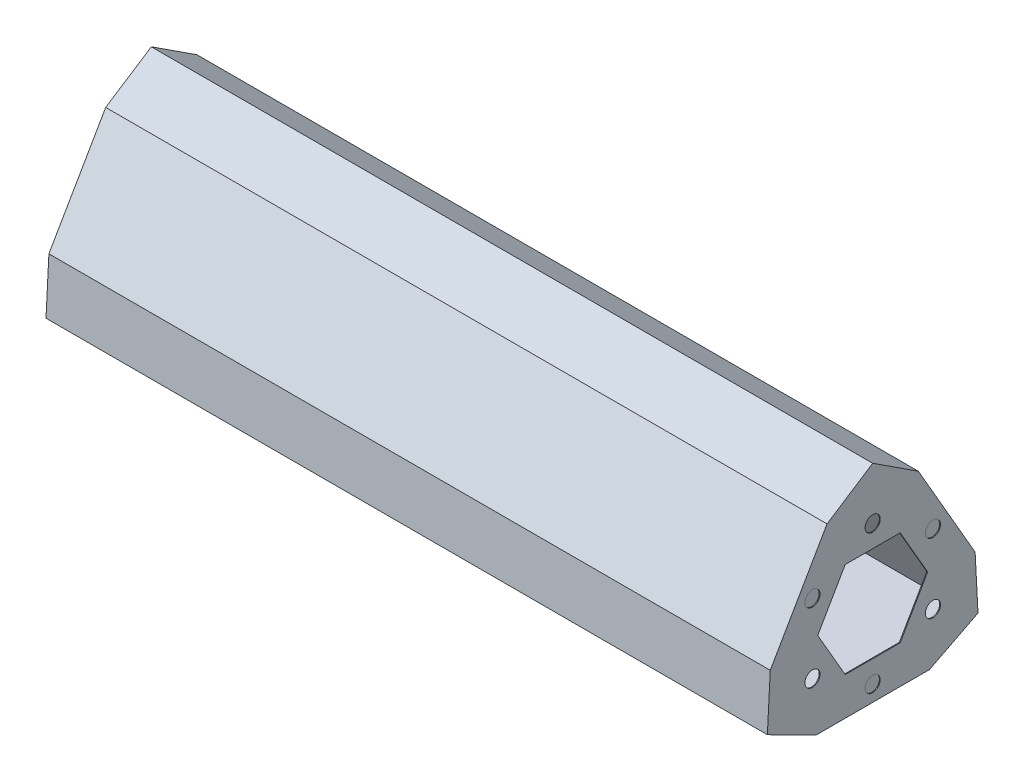
ISO-10303-21;
HEADER;
FILE_DESCRIPTION(('STEP AP214'),'2;1');
FILE_NAME('part.step','',(''),(''),'','','');
FILE_SCHEMA(('AUTOMOTIVE_DESIGN { 1 0 10303 214 1 1 1 1 }'));
ENDSEC;
DATA;
#1=APPLICATION_CONTEXT('core data for automotive mechanical design processes');
#2=APPLICATION_PROTOCOL_DEFINITION('international standard','automotive_design',2000,#1);
#3=PRODUCT_CONTEXT('',#1,'mechanical');
#4=PRODUCT('Part','Part','',(#3));
#5=PRODUCT_RELATED_PRODUCT_CATEGORY('part','',(#4));
#6=PRODUCT_DEFINITION_FORMATION('','',#4);
#7=PRODUCT_DEFINITION_CONTEXT('part definition',#1,'design');
#8=PRODUCT_DEFINITION('design','',#6,#7);
#9=PRODUCT_DEFINITION_SHAPE('','',#8);
#10=(LENGTH_UNIT() NAMED_UNIT(*) SI_UNIT(.MILLI.,.METRE.));
#11=(NAMED_UNIT(*) PLANE_ANGLE_UNIT() SI_UNIT($,.RADIAN.));
#12=(NAMED_UNIT(*) SI_UNIT($,.STERADIAN.) SOLID_ANGLE_UNIT());
#13=UNCERTAINTY_MEASURE_WITH_UNIT(LENGTH_MEASURE(1.E-05),#10,'distance_accuracy_value','');
#14=(GEOMETRIC_REPRESENTATION_CONTEXT(3) GLOBAL_UNCERTAINTY_ASSIGNED_CONTEXT((#13)) GLOBAL_UNIT_ASSIGNED_CONTEXT((#10,
#11,#12)) REPRESENTATION_CONTEXT('',''));
#15=CARTESIAN_POINT('',(0.,0.,0.));
#16=DIRECTION('',(0.,0.,1.));
#17=DIRECTION('',(1.,0.,0.));
#18=AXIS2_PLACEMENT_3D('',#15,#16,#17);
#19=CARTESIAN_POINT('',(152.4,21.8761469360305,-37.8905979670466));
#20=DIRECTION('',(0.,-0.500000000000005,0.866025403784435));
#21=DIRECTION('',(0.,-0.866025403784436,-0.500000000000006));
#22=AXIS2_PLACEMENT_3D('',#19,#20,#21);
#23=PLANE('',#22);
#24=DIRECTION('',(0.,0.866025403784436,0.500000000000006));
#25=VECTOR('',#24,1.);
#26=CARTESIAN_POINT('',(0.,21.8761469360305,-37.8905979670466));
#27=LINE('',#26,#25);
#28=CARTESIAN_POINT('',(0.,11.4838420906171,-43.8905979670468));
#29=VERTEX_POINT('',#28);
#30=CARTESIAN_POINT('',(0.,32.2684517814436,-31.8905979670466));
#31=VERTEX_POINT('',#30);
#32=EDGE_CURVE('E345',#29,#31,#27,.T.);
#33=ORIENTED_EDGE('',*,*,#32,.T.);
#34=DIRECTION('',(-1.,0.,0.));
#35=VECTOR('',#34,1.);
#36=CARTESIAN_POINT('',(152.4,32.2684517814436,-31.8905979670466));
#37=LINE('',#36,#35);
#38=CARTESIAN_POINT('',(152.4,32.2684517814436,-31.8905979670466));
#39=VERTEX_POINT('',#38);
#40=EDGE_CURVE('E12',#39,#31,#37,.T.);
#41=ORIENTED_EDGE('',*,*,#40,.F.);
#42=DIRECTION('',(0.,0.866025403784436,0.500000000000006));
#43=VECTOR('',#42,1.);
#44=CARTESIAN_POINT('',(152.4,21.8761469360305,-37.8905979670466));
#45=LINE('',#44,#43);
#46=CARTESIAN_POINT('',(152.4,11.4838420906171,-43.8905979670468));
#47=VERTEX_POINT('',#46);
#48=EDGE_CURVE('E361',#47,#39,#45,.T.);
#49=ORIENTED_EDGE('',*,*,#48,.F.);
#50=DIRECTION('',(-1.,0.,0.));
#51=VECTOR('',#50,1.);
#52=CARTESIAN_POINT('',(152.4,11.4838420906171,-43.8905979670468));
#53=LINE('',#52,#51);
#54=EDGE_CURVE('E392',#47,#29,#53,.T.);
#55=ORIENTED_EDGE('',*,*,#54,.T.);
#56=EDGE_LOOP('',(#33,#41,#49,#55));
#57=FACE_BOUND('',#56,.T.);
#58=ADVANCED_FACE('F45',(#57),#23,.F.);
#59=CARTESIAN_POINT('',(152.4,37.2525078239312,-24.2268431001882));
#60=DIRECTION('',(0.,-0.838312866699757,0.545189451040311));
#61=DIRECTION('',(0.,-0.545189451040311,-0.838312866699757));
#62=AXIS2_PLACEMENT_3D('',#59,#60,#61);
#63=PLANE('',#62);
#64=DIRECTION('',(0.,0.545189451040311,0.838312866699757));
#65=VECTOR('',#64,1.);
#66=CARTESIAN_POINT('',(0.,37.2525078239312,-24.2268431001882));
#67=LINE('',#66,#65);
#68=CARTESIAN_POINT('',(0.,38.5381304684071,-22.2499999999991));
#69=VERTEX_POINT('',#68);
#70=EDGE_CURVE('E396',#31,#69,#67,.T.);
#71=ORIENTED_EDGE('',*,*,#70,.T.);
#72=DIRECTION('',(-1.,0.,0.));
#73=VECTOR('',#72,1.);
#74=CARTESIAN_POINT('',(152.4,38.5381304684071,-22.2499999999991));
#75=LINE('',#74,#73);
#76=CARTESIAN_POINT('',(152.4,38.5381304684071,-22.2499999999991));
#77=VERTEX_POINT('',#76);
#78=EDGE_CURVE('E53',#77,#69,#75,.T.);
#79=ORIENTED_EDGE('',*,*,#78,.F.);
#80=DIRECTION('',(0.,0.545189451040311,0.838312866699757));
#81=VECTOR('',#80,1.);
#82=CARTESIAN_POINT('',(152.4,37.2525078239312,-24.2268431001882));
#83=LINE('',#82,#81);
#84=EDGE_CURVE('E365',#39,#77,#83,.T.);
#85=ORIENTED_EDGE('',*,*,#84,.F.);
#86=ORIENTED_EDGE('',*,*,#40,.T.);
#87=EDGE_LOOP('',(#71,#79,#85,#86));
#88=FACE_BOUND('',#87,.T.);
#89=ADVANCED_FACE('F453',(#88),#63,.F.);
#90=CARTESIAN_POINT('',(152.4,16.9142575679085,11.0000396802978));
#91=DIRECTION('',(0.,0.838312866699781,0.545189451040274));
#92=DIRECTION('',(0.,-0.545189451040274,0.838312866699781));
#93=AXIS2_PLACEMENT_3D('',#90,#91,#92);
#94=PLANE('',#93);
#95=DIRECTION('',(0.,0.545189451040274,-0.838312866699781));
#96=VECTOR('',#95,1.);
#97=CARTESIAN_POINT('',(0.,16.9142575679085,11.0000396802978));
#98=LINE('',#97,#96);
#99=CARTESIAN_POINT('',(0.,32.2684517814438,-12.6094020329519));
#100=VERTEX_POINT('',#99);
#101=EDGE_CURVE('E400',#100,#69,#98,.T.);
#102=ORIENTED_EDGE('',*,*,#101,.F.);
#103=DIRECTION('',(-1.,0.,0.));
#104=VECTOR('',#103,1.);
#105=CARTESIAN_POINT('',(152.4,32.2684517814438,-12.6094020329519));
#106=LINE('',#105,#104);
#107=CARTESIAN_POINT('',(152.4,32.2684517814438,-12.6094020329519));
#108=VERTEX_POINT('',#107);
#109=EDGE_CURVE('E444',#108,#100,#106,.T.);
#110=ORIENTED_EDGE('',*,*,#109,.F.);
#111=DIRECTION('',(0.,0.545189451040274,-0.838312866699781));
#112=VECTOR('',#111,1.);
#113=CARTESIAN_POINT('',(152.4,16.9142575679085,11.0000396802978));
#114=LINE('',#113,#112);
#115=EDGE_CURVE('E369',#108,#77,#114,.T.);
#116=ORIENTED_EDGE('',*,*,#115,.T.);
#117=ORIENTED_EDGE('',*,*,#78,.T.);
#118=EDGE_LOOP('',(#102,#110,#116,#117));
#119=FACE_BOUND('',#118,.T.);
#120=ADVANCED_FACE('F450',(#119),#94,.T.);
#121=CARTESIAN_POINT('',(152.4,2.60708170182693,4.51559796704751));
#122=DIRECTION('',(0.,0.49999999999999,0.866025403784444));
#123=DIRECTION('',(0.,-0.866025403784445,0.49999999999999));
#124=AXIS2_PLACEMENT_3D('',#121,#122,#123);
#125=PLANE('',#124);
#126=DIRECTION('',(0.,0.866025403784445,-0.49999999999999));
#127=VECTOR('',#126,1.);
#128=CARTESIAN_POINT('',(0.,2.60708170182693,4.51559796704751));
#129=LINE('',#128,#127);
#130=CARTESIAN_POINT('',(0.,11.4838420906171,-0.609402032952183));
#131=VERTEX_POINT('',#130);
#132=EDGE_CURVE('E404',#131,#100,#129,.T.);
#133=ORIENTED_EDGE('',*,*,#132,.F.);
#134=DIRECTION('',(-1.,0.,0.));
#135=VECTOR('',#134,1.);
#136=CARTESIAN_POINT('',(152.4,11.4838420906171,-0.609402032952183));
#137=LINE('',#136,#135);
#138=CARTESIAN_POINT('',(152.4,11.4838420906171,-0.609402032952183));
#139=VERTEX_POINT('',#138);
#140=EDGE_CURVE('E441',#139,#131,#137,.T.);
#141=ORIENTED_EDGE('',*,*,#140,.F.);
#142=DIRECTION('',(0.,0.866025403784445,-0.49999999999999));
#143=VECTOR('',#142,1.);
#144=CARTESIAN_POINT('',(152.4,2.60708170182693,4.51559796704751));
#145=LINE('',#144,#143);
#146=EDGE_CURVE('E373',#139,#108,#145,.T.);
#147=ORIENTED_EDGE('',*,*,#146,.T.);
#148=ORIENTED_EDGE('',*,*,#109,.T.);
#149=EDGE_LOOP('',(#133,#141,#147,#148));
#150=FACE_BOUND('',#149,.T.);
#151=ADVANCED_FACE('F462',(#150),#125,.T.);
#152=CARTESIAN_POINT('',(152.4,0.,0.));
#153=DIRECTION('',(0.,-0.0529914811262776,-0.998594964401505));
#154=DIRECTION('',(0.,0.998594964401505,-0.0529914811262776));
#155=AXIS2_PLACEMENT_3D('',#152,#153,#154);
#156=PLANE('',#155);
#157=DIRECTION('',(0.,-0.998594964401505,0.0529914811262776));
#158=VECTOR('',#157,1.);
#159=CARTESIAN_POINT('',(0.,0.,0.));
#160=LINE('',#159,#158);
#161=CARTESIAN_POINT('',(0.,0.,0.));
#162=VERTEX_POINT('',#161);
#163=EDGE_CURVE('E408',#131,#162,#160,.T.);
#164=ORIENTED_EDGE('',*,*,#163,.T.);
#165=DIRECTION('',(-1.,0.,0.));
#166=VECTOR('',#165,1.);
#167=CARTESIAN_POINT('',(152.4,0.,0.));
#168=LINE('',#167,#166);
#169=CARTESIAN_POINT('',(152.4,0.,0.));
#170=VERTEX_POINT('',#169);
#171=EDGE_CURVE('E437',#170,#162,#168,.T.);
#172=ORIENTED_EDGE('',*,*,#171,.F.);
#173=DIRECTION('',(0.,-0.998594964401505,0.0529914811262776));
#174=VECTOR('',#173,1.);
#175=CARTESIAN_POINT('',(152.4,0.,0.));
#176=LINE('',#175,#174);
#177=EDGE_CURVE('E377',#139,#170,#176,.T.);
#178=ORIENTED_EDGE('',*,*,#177,.F.);
#179=ORIENTED_EDGE('',*,*,#140,.T.);
#180=EDGE_LOOP('',(#164,#172,#178,#179));
#181=FACE_BOUND('',#180,.T.);
#182=ADVANCED_FACE('F490',(#181),#156,.F.);
#183=CARTESIAN_POINT('',(152.4,0.,0.));
#184=DIRECTION('',(0.,0.891304347826082,-0.453405513361187));
#185=DIRECTION('',(0.,0.453405513361187,0.891304347826083));
#186=AXIS2_PLACEMENT_3D('',#183,#184,#185);
#187=PLANE('',#186);
#188=DIRECTION('',(0.,-0.453405513361187,-0.891304347826083));
#189=VECTOR('',#188,1.);
#190=CARTESIAN_POINT('',(0.,0.,0.));
#191=LINE('',#190,#189);
#192=CARTESIAN_POINT('',(0.,-5.21416340365368,-10.25));
#193=VERTEX_POINT('',#192);
#194=EDGE_CURVE('E411',#162,#193,#191,.T.);
#195=ORIENTED_EDGE('',*,*,#194,.T.);
#196=DIRECTION('',(-1.,0.,0.));
#197=VECTOR('',#196,1.);
#198=CARTESIAN_POINT('',(152.4,-5.21416340365368,-10.25));
#199=LINE('',#198,#197);
#200=CARTESIAN_POINT('',(152.4,-5.21416340365368,-10.25));
#201=VERTEX_POINT('',#200);
#202=EDGE_CURVE('E433',#201,#193,#199,.T.);
#203=ORIENTED_EDGE('',*,*,#202,.F.);
#204=DIRECTION('',(0.,-0.453405513361187,-0.891304347826083));
#205=VECTOR('',#204,1.);
#206=CARTESIAN_POINT('',(152.4,0.,0.));
#207=LINE('',#206,#205);
#208=EDGE_CURVE('E380',#170,#201,#207,.T.);
#209=ORIENTED_EDGE('',*,*,#208,.F.);
#210=ORIENTED_EDGE('',*,*,#171,.T.);
#211=EDGE_LOOP('',(#195,#203,#209,#210));
#212=FACE_BOUND('',#211,.T.);
#213=ADVANCED_FACE('F486',(#212),#187,.F.);
#214=CARTESIAN_POINT('',(152.4,-5.21416340365397,0.));
#215=DIRECTION('',(0.,1.,0.));
#216=DIRECTION('',(0.,0.,1.));
#217=AXIS2_PLACEMENT_3D('',#214,#215,#216);
#218=PLANE('',#217);
#219=DIRECTION('',(0.,0.,-1.));
#220=VECTOR('',#219,1.);
#221=CARTESIAN_POINT('',(0.,-5.21416340365397,0.));
#222=LINE('',#221,#220);
#223=CARTESIAN_POINT('',(0.,-5.21416340365397,-34.25));
#224=VERTEX_POINT('',#223);
#225=EDGE_CURVE('E414',#193,#224,#222,.T.);
#226=ORIENTED_EDGE('',*,*,#225,.T.);
#227=DIRECTION('',(-1.,0.,0.));
#228=VECTOR('',#227,1.);
#229=CARTESIAN_POINT('',(152.4,-5.21416340365397,-34.25));
#230=LINE('',#229,#228);
#231=CARTESIAN_POINT('',(152.4,-5.21416340365397,-34.25));
#232=VERTEX_POINT('',#231);
#233=EDGE_CURVE('E429',#232,#224,#230,.T.);
#234=ORIENTED_EDGE('',*,*,#233,.F.);
#235=DIRECTION('',(0.,0.,-1.));
#236=VECTOR('',#235,1.);
#237=CARTESIAN_POINT('',(152.4,-5.21416340365397,0.));
#238=LINE('',#237,#236);
#239=EDGE_CURVE('E383',#201,#232,#238,.T.);
#240=ORIENTED_EDGE('',*,*,#239,.F.);
#241=ORIENTED_EDGE('',*,*,#202,.T.);
#242=EDGE_LOOP('',(#226,#234,#240,#241));
#243=FACE_BOUND('',#242,.T.);
#244=ADVANCED_FACE('F483',(#243),#218,.F.);
#245=CARTESIAN_POINT('',(152.4,-17.9834425897285,-9.14815689981215));
#246=DIRECTION('',(0.,0.891304347826072,0.453405513361208));
#247=DIRECTION('',(0.,-0.453405513361208,0.891304347826072));
#248=AXIS2_PLACEMENT_3D('',#245,#246,#247);
#249=PLANE('',#248);
#250=DIRECTION('',(0.,0.453405513361208,-0.891304347826072));
#251=VECTOR('',#250,1.);
#252=CARTESIAN_POINT('',(0.,-17.9834425897285,-9.14815689981215));
#253=LINE('',#252,#251);
#254=CARTESIAN_POINT('',(0.,0.,-44.5));
#255=VERTEX_POINT('',#254);
#256=EDGE_CURVE('E417',#224,#255,#253,.T.);
#257=ORIENTED_EDGE('',*,*,#256,.T.);
#258=DIRECTION('',(-1.,0.,0.));
#259=VECTOR('',#258,1.);
#260=CARTESIAN_POINT('',(152.4,0.,-44.5));
#261=LINE('',#260,#259);
#262=CARTESIAN_POINT('',(152.4,0.,-44.5));
#263=VERTEX_POINT('',#262);
#264=EDGE_CURVE('E425',#263,#255,#261,.T.);
#265=ORIENTED_EDGE('',*,*,#264,.F.);
#266=DIRECTION('',(0.,0.453405513361208,-0.891304347826072));
#267=VECTOR('',#266,1.);
#268=CARTESIAN_POINT('',(152.4,-17.9834425897285,-9.14815689981215));
#269=LINE('',#268,#267);
#270=EDGE_CURVE('E386',#232,#263,#269,.T.);
#271=ORIENTED_EDGE('',*,*,#270,.F.);
#272=ORIENTED_EDGE('',*,*,#233,.T.);
#273=EDGE_LOOP('',(#257,#265,#271,#272));
#274=FACE_BOUND('',#273,.T.);
#275=ADVANCED_FACE('F479',(#274),#249,.F.);
#276=CARTESIAN_POINT('',(152.4,2.35480766629917,-44.3750396802975));
#277=DIRECTION('',(0.,-0.0529914811263699,0.9985949644015));
#278=DIRECTION('',(0.,-0.9985949644015,-0.0529914811263699));
#279=AXIS2_PLACEMENT_3D('',#276,#277,#278);
#280=PLANE('',#279);
#281=DIRECTION('',(0.,0.9985949644015,0.0529914811263699));
#282=VECTOR('',#281,1.);
#283=CARTESIAN_POINT('',(0.,2.35480766629917,-44.3750396802975));
#284=LINE('',#283,#282);
#285=EDGE_CURVE('E366',#255,#29,#284,.T.);
#286=ORIENTED_EDGE('',*,*,#285,.T.);
#287=ORIENTED_EDGE('',*,*,#54,.F.);
#288=DIRECTION('',(0.,0.9985949644015,0.0529914811263699));
#289=VECTOR('',#288,1.);
#290=CARTESIAN_POINT('',(152.4,2.35480766629917,-44.3750396802975));
#291=LINE('',#290,#289);
#292=EDGE_CURVE('E389',#263,#47,#291,.T.);
#293=ORIENTED_EDGE('',*,*,#292,.F.);
#294=ORIENTED_EDGE('',*,*,#264,.T.);
#295=EDGE_LOOP('',(#286,#287,#293,#294));
#296=FACE_BOUND('',#295,.T.);
#297=ADVANCED_FACE('F475',(#296),#280,.F.);
#298=CARTESIAN_POINT('',(152.4,0.,0.));
#299=DIRECTION('',(1.,0.,0.));
#300=DIRECTION('',(0.,0.,-1.));
#301=AXIS2_PLACEMENT_3D('',#298,#299,#300);
#302=PLANE('',#301);
#303=CARTESIAN_POINT('',(152.4,20.1920869789371,-9.52627944162922));
#304=DIRECTION('',(1.,0.,0.));
#305=DIRECTION('',(0.,0.,-1.));
#306=AXIS2_PLACEMENT_3D('',#303,#304,#305);
#307=CIRCLE('',#306,1.59999999999996);
#308=CARTESIAN_POINT('',(152.4,20.1920869789371,-11.1262794416292));
#309=VERTEX_POINT('',#308);
#310=EDGE_CURVE('E267',#309,#309,#307,.T.);
#311=ORIENTED_EDGE('',*,*,#310,.F.);
#312=EDGE_LOOP('',(#311));
#313=FACE_BOUND('',#312,.T.);
#314=CARTESIAN_POINT('',(152.4,5.4999999999991,-9.52627944163036));
#315=DIRECTION('',(1.,0.,0.));
#316=DIRECTION('',(0.,0.,-1.));
#317=AXIS2_PLACEMENT_3D('',#314,#315,#316);
#318=CIRCLE('',#317,1.59999999999933);
#319=CARTESIAN_POINT('',(152.4,5.4999999999991,-11.1262794416297));
#320=VERTEX_POINT('',#319);
#321=EDGE_CURVE('E287',#320,#320,#318,.T.);
#322=ORIENTED_EDGE('',*,*,#321,.F.);
#323=EDGE_LOOP('',(#322));
#324=FACE_BOUND('',#323,.T.);
#325=CARTESIAN_POINT('',(152.4,-1.84604348946889,-22.2500000000018));
#326=DIRECTION('',(1.,0.,0.));
#327=DIRECTION('',(0.,0.,-1.));
#328=AXIS2_PLACEMENT_3D('',#325,#326,#327);
#329=CIRCLE('',#328,1.59999999999944);
#330=CARTESIAN_POINT('',(152.4,-1.84604348946889,-23.8500000000012));
#331=VERTEX_POINT('',#330);
#332=EDGE_CURVE('E283',#331,#331,#329,.T.);
#333=ORIENTED_EDGE('',*,*,#332,.F.);
#334=EDGE_LOOP('',(#333));
#335=FACE_BOUND('',#334,.T.);
#336=CARTESIAN_POINT('',(152.4,5.50000000000108,-34.9737205583721));
#337=DIRECTION('',(1.,0.,0.));
#338=DIRECTION('',(0.,0.,-1.));
#339=AXIS2_PLACEMENT_3D('',#336,#337,#338);
#340=CIRCLE('',#339,1.60000000000013);
#341=CARTESIAN_POINT('',(152.4,5.50000000000108,-36.5737205583722));
#342=VERTEX_POINT('',#341);
#343=EDGE_CURVE('E272',#342,#342,#340,.T.);
#344=ORIENTED_EDGE('',*,*,#343,.F.);
#345=EDGE_LOOP('',(#344));
#346=FACE_BOUND('',#345,.T.);
#347=CARTESIAN_POINT('',(152.4,27.538130468407,-22.2499999999995));
#348=DIRECTION('',(1.,0.,0.));
#349=DIRECTION('',(0.,0.,-1.));
#350=AXIS2_PLACEMENT_3D('',#347,#348,#349);
#351=CIRCLE('',#350,1.60000000000047);
#352=CARTESIAN_POINT('',(152.4,27.538130468407,-23.85));
#353=VERTEX_POINT('',#352);
#354=EDGE_CURVE('E262',#353,#353,#351,.T.);
#355=ORIENTED_EDGE('',*,*,#354,.F.);
#356=EDGE_LOOP('',(#355));
#357=FACE_BOUND('',#356,.T.);
#358=CARTESIAN_POINT('',(152.4,20.192086978939,-34.9737205583709));
#359=DIRECTION('',(1.,0.,0.));
#360=DIRECTION('',(0.,0.,-1.));
#361=AXIS2_PLACEMENT_3D('',#358,#359,#360);
#362=CIRCLE('',#361,1.60000000000063);
#363=CARTESIAN_POINT('',(152.4,20.192086978939,-36.5737205583715));
#364=VERTEX_POINT('',#363);
#365=EDGE_CURVE('E258',#364,#364,#362,.T.);
#366=ORIENTED_EDGE('',*,*,#365,.F.);
#367=EDGE_LOOP('',(#366));
#368=FACE_BOUND('',#367,.T.);
#369=DIRECTION('',(0.,0.,1.));
#370=VECTOR('',#369,1.);
#371=CARTESIAN_POINT('',(152.4,22.9062503825923,-28.058263157847));
#372=LINE('',#371,#370);
#373=CARTESIAN_POINT('',(152.4,22.9062503825923,-28.058263157847));
#374=VERTEX_POINT('',#373);
#375=CARTESIAN_POINT('',(152.4,22.9062503825923,-16.4417368421512));
#376=VERTEX_POINT('',#375);
#377=EDGE_CURVE('E257',#374,#376,#372,.T.);
#378=ORIENTED_EDGE('',*,*,#377,.F.);
#379=DIRECTION('',(0.,0.866025403784439,0.5));
#380=VECTOR('',#379,1.);
#381=CARTESIAN_POINT('',(152.4,12.8460434894693,-33.8665263156949));
#382=LINE('',#381,#380);
#383=CARTESIAN_POINT('',(152.4,12.8460434894693,-33.8665263156949));
#384=VERTEX_POINT('',#383);
#385=EDGE_CURVE('E305',#384,#374,#382,.T.);
#386=ORIENTED_EDGE('',*,*,#385,.F.);
#387=DIRECTION('',(0.,0.866025403784439,-0.5));
#388=VECTOR('',#387,1.);
#389=CARTESIAN_POINT('',(152.4,2.78583659634632,-28.058263157847));
#390=LINE('',#389,#388);
#391=CARTESIAN_POINT('',(152.4,2.78583659634632,-28.058263157847));
#392=VERTEX_POINT('',#391);
#393=EDGE_CURVE('E335',#392,#384,#390,.T.);
#394=ORIENTED_EDGE('',*,*,#393,.F.);
#395=DIRECTION('',(0.,0.,-1.));
#396=VECTOR('',#395,1.);
#397=CARTESIAN_POINT('',(152.4,2.78583659634632,-16.4417368421512));
#398=LINE('',#397,#396);
#399=CARTESIAN_POINT('',(152.4,2.78583659634632,-16.4417368421512));
#400=VERTEX_POINT('',#399);
#401=EDGE_CURVE('E331',#400,#392,#398,.T.);
#402=ORIENTED_EDGE('',*,*,#401,.F.);
#403=DIRECTION('',(0.,-0.866025403784439,-0.5));
#404=VECTOR('',#403,1.);
#405=CARTESIAN_POINT('',(152.4,12.8460434894693,-10.6334736843033));
#406=LINE('',#405,#404);
#407=CARTESIAN_POINT('',(152.4,12.8460434894693,-10.6334736843033));
#408=VERTEX_POINT('',#407);
#409=EDGE_CURVE('E327',#408,#400,#406,.T.);
#410=ORIENTED_EDGE('',*,*,#409,.F.);
#411=DIRECTION('',(0.,-0.866025403784439,0.5));
#412=VECTOR('',#411,1.);
#413=CARTESIAN_POINT('',(152.4,22.9062503825923,-16.4417368421512));
#414=LINE('',#413,#412);
#415=EDGE_CURVE('E323',#376,#408,#414,.T.);
#416=ORIENTED_EDGE('',*,*,#415,.F.);
#417=EDGE_LOOP('',(#378,#386,#394,#402,#410,#416));
#418=FACE_BOUND('',#417,.T.);
#419=ORIENTED_EDGE('',*,*,#48,.T.);
#420=ORIENTED_EDGE('',*,*,#84,.T.);
#421=ORIENTED_EDGE('',*,*,#115,.F.);
#422=ORIENTED_EDGE('',*,*,#146,.F.);
#423=ORIENTED_EDGE('',*,*,#177,.T.);
#424=ORIENTED_EDGE('',*,*,#208,.T.);
#425=ORIENTED_EDGE('',*,*,#239,.T.);
#426=ORIENTED_EDGE('',*,*,#270,.T.);
#427=ORIENTED_EDGE('',*,*,#292,.T.);
#428=EDGE_LOOP('',(#419,#420,#421,#422,#423,#424,#425,#426,#427));
#429=FACE_BOUND('',#428,.T.);
#430=ADVANCED_FACE('F466',(#313,#324,#335,#346,#357,#368,#418,#429),#302,.T.);
#431=CARTESIAN_POINT('',(0.,0.,0.));
#432=DIRECTION('',(1.,0.,0.));
#433=DIRECTION('',(0.,0.,-1.));
#434=AXIS2_PLACEMENT_3D('',#431,#432,#433);
#435=PLANE('',#434);
#436=CARTESIAN_POINT('',(0.,3.93856620135815,-22.2499999999997));
#437=DIRECTION('',(-1.,0.,0.));
#438=DIRECTION('',(0.,0.,1.));
#439=AXIS2_PLACEMENT_3D('',#436,#437,#438);
#440=CIRCLE('',#439,1.60000000000022);
#441=CARTESIAN_POINT('',(0.,3.93856620135815,-20.6499999999995));
#442=VERTEX_POINT('',#441);
#443=EDGE_CURVE('E831',#442,#442,#440,.T.);
#444=ORIENTED_EDGE('',*,*,#443,.F.);
#445=EDGE_LOOP('',(#444));
#446=FACE_BOUND('',#445,.T.);
#447=CARTESIAN_POINT('',(0.,17.2997821335251,-14.5358983848622));
#448=DIRECTION('',(-1.,0.,0.));
#449=DIRECTION('',(0.,0.,1.));
#450=AXIS2_PLACEMENT_3D('',#447,#448,#449);
#451=CIRCLE('',#450,1.60000000000037);
#452=CARTESIAN_POINT('',(0.,17.2997821335251,-12.9358983848618));
#453=VERTEX_POINT('',#452);
#454=EDGE_CURVE('E836',#453,#453,#451,.T.);
#455=ORIENTED_EDGE('',*,*,#454,.F.);
#456=EDGE_LOOP('',(#455));
#457=FACE_BOUND('',#456,.T.);
#458=CARTESIAN_POINT('',(0.,17.2997821335252,-29.9641016151369));
#459=DIRECTION('',(-1.,0.,0.));
#460=DIRECTION('',(0.,0.,1.));
#461=AXIS2_PLACEMENT_3D('',#458,#459,#460);
#462=CIRCLE('',#461,1.59999999999932);
#463=CARTESIAN_POINT('',(0.,17.2997821335252,-28.3641016151376));
#464=VERTEX_POINT('',#463);
#465=EDGE_CURVE('E851',#464,#464,#462,.T.);
#466=ORIENTED_EDGE('',*,*,#465,.F.);
#467=EDGE_LOOP('',(#466));
#468=FACE_BOUND('',#467,.T.);
#469=DIRECTION('',(0.,0.,1.));
#470=VECTOR('',#469,1.);
#471=CARTESIAN_POINT('',(0.,7.93856620135751,-30.7499999999991));
#472=LINE('',#471,#470);
#473=CARTESIAN_POINT('',(0.,7.93856620135751,-30.7499999999991));
#474=VERTEX_POINT('',#473);
#475=CARTESIAN_POINT('',(0.,7.93856620135751,-13.7499999999991));
#476=VERTEX_POINT('',#475);
#477=EDGE_CURVE('E60',#474,#476,#472,.T.);
#478=ORIENTED_EDGE('',*,*,#477,.F.);
#479=DIRECTION('',(0.,-0.866025403784439,-0.5));
#480=VECTOR('',#479,1.);
#481=CARTESIAN_POINT('',(0.,22.660998065693,-22.2499999999991));
#482=LINE('',#481,#480);
#483=CARTESIAN_POINT('',(0.,22.660998065693,-22.2499999999991));
#484=VERTEX_POINT('',#483);
#485=EDGE_CURVE('E202',#484,#474,#482,.T.);
#486=ORIENTED_EDGE('',*,*,#485,.F.);
#487=DIRECTION('',(0.,0.866025403784439,-0.5));
#488=VECTOR('',#487,1.);
#489=CARTESIAN_POINT('',(0.,7.93856620135751,-13.7499999999991));
#490=LINE('',#489,#488);
#491=EDGE_CURVE('E214',#476,#484,#490,.T.);
#492=ORIENTED_EDGE('',*,*,#491,.F.);
#493=EDGE_LOOP('',(#478,#486,#492));
#494=FACE_BOUND('',#493,.T.);
#495=ORIENTED_EDGE('',*,*,#32,.F.);
#496=ORIENTED_EDGE('',*,*,#285,.F.);
#497=ORIENTED_EDGE('',*,*,#256,.F.);
#498=ORIENTED_EDGE('',*,*,#225,.F.);
#499=ORIENTED_EDGE('',*,*,#194,.F.);
#500=ORIENTED_EDGE('',*,*,#163,.F.);
#501=ORIENTED_EDGE('',*,*,#132,.T.);
#502=ORIENTED_EDGE('',*,*,#101,.T.);
#503=ORIENTED_EDGE('',*,*,#70,.F.);
#504=EDGE_LOOP('',(#495,#496,#497,#498,#499,#500,#501,#502,#503));
#505=FACE_BOUND('',#504,.T.);
#506=ADVANCED_FACE('F457',(#446,#457,#468,#494,#505),#435,.F.);
#507=CARTESIAN_POINT('',(152.2222,22.9062503825923,-28.058263157847));
#508=DIRECTION('',(0.,1.,0.));
#509=DIRECTION('',(0.,0.,1.));
#510=AXIS2_PLACEMENT_3D('',#507,#508,#509);
#511=PLANE('',#510);
#512=ORIENTED_EDGE('',*,*,#377,.T.);
#513=DIRECTION('',(1.,0.,0.));
#514=VECTOR('',#513,1.);
#515=CARTESIAN_POINT('',(152.2222,22.9062503825923,-16.4417368421512));
#516=LINE('',#515,#514);
#517=CARTESIAN_POINT('',(152.2222,22.9062503825923,-16.4417368421512));
#518=VERTEX_POINT('',#517);
#519=EDGE_CURVE('E320',#518,#376,#516,.T.);
#520=ORIENTED_EDGE('',*,*,#519,.F.);
#521=DIRECTION('',(0.,0.,1.));
#522=VECTOR('',#521,1.);
#523=CARTESIAN_POINT('',(152.2222,22.9062503825923,-28.058263157847));
#524=LINE('',#523,#522);
#525=CARTESIAN_POINT('',(152.2222,22.9062503825923,-28.058263157847));
#526=VERTEX_POINT('',#525);
#527=EDGE_CURVE('E301',#526,#518,#524,.T.);
#528=ORIENTED_EDGE('',*,*,#527,.F.);
#529=DIRECTION('',(1.,0.,0.));
#530=VECTOR('',#529,1.);
#531=CARTESIAN_POINT('',(152.2222,22.9062503825923,-28.058263157847));
#532=LINE('',#531,#530);
#533=EDGE_CURVE('E342',#526,#374,#532,.T.);
#534=ORIENTED_EDGE('',*,*,#533,.T.);
#535=EDGE_LOOP('',(#512,#520,#528,#534));
#536=FACE_BOUND('',#535,.T.);
#537=ADVANCED_FACE('F662',(#536),#511,.F.);
#538=CARTESIAN_POINT('',(152.2222,12.8460434894693,-33.8665263156949));
#539=DIRECTION('',(0.,0.5,-0.866025403784439));
#540=DIRECTION('',(0.,0.866025403784439,0.5));
#541=AXIS2_PLACEMENT_3D('',#538,#539,#540);
#542=PLANE('',#541);
#543=ORIENTED_EDGE('',*,*,#385,.T.);
#544=ORIENTED_EDGE('',*,*,#533,.F.);
#545=DIRECTION('',(0.,0.866025403784439,0.5));
#546=VECTOR('',#545,1.);
#547=CARTESIAN_POINT('',(152.2222,12.8460434894693,-33.8665263156949));
#548=LINE('',#547,#546);
#549=CARTESIAN_POINT('',(152.2222,12.8460434894693,-33.8665263156949));
#550=VERTEX_POINT('',#549);
#551=EDGE_CURVE('E317',#550,#526,#548,.T.);
#552=ORIENTED_EDGE('',*,*,#551,.F.);
#553=DIRECTION('',(1.,0.,0.));
#554=VECTOR('',#553,1.);
#555=CARTESIAN_POINT('',(152.2222,12.8460434894693,-33.8665263156949));
#556=LINE('',#555,#554);
#557=EDGE_CURVE('E346',#550,#384,#556,.T.);
#558=ORIENTED_EDGE('',*,*,#557,.T.);
#559=EDGE_LOOP('',(#543,#544,#552,#558));
#560=FACE_BOUND('',#559,.T.);
#561=ADVANCED_FACE('F667',(#560),#542,.F.);
#562=CARTESIAN_POINT('',(152.2222,2.78583659634632,-28.058263157847));
#563=DIRECTION('',(0.,-0.5,-0.866025403784439));
#564=DIRECTION('',(0.,0.866025403784439,-0.5));
#565=AXIS2_PLACEMENT_3D('',#562,#563,#564);
#566=PLANE('',#565);
#567=ORIENTED_EDGE('',*,*,#393,.T.);
#568=ORIENTED_EDGE('',*,*,#557,.F.);
#569=DIRECTION('',(0.,0.866025403784439,-0.5));
#570=VECTOR('',#569,1.);
#571=CARTESIAN_POINT('',(152.2222,2.78583659634632,-28.058263157847));
#572=LINE('',#571,#570);
#573=CARTESIAN_POINT('',(152.2222,2.78583659634632,-28.058263157847));
#574=VERTEX_POINT('',#573);
#575=EDGE_CURVE('E314',#574,#550,#572,.T.);
#576=ORIENTED_EDGE('',*,*,#575,.F.);
#577=DIRECTION('',(1.,0.,0.));
#578=VECTOR('',#577,1.);
#579=CARTESIAN_POINT('',(152.2222,2.78583659634632,-28.058263157847));
#580=LINE('',#579,#578);
#581=EDGE_CURVE('E349',#574,#392,#580,.T.);
#582=ORIENTED_EDGE('',*,*,#581,.T.);
#583=EDGE_LOOP('',(#567,#568,#576,#582));
#584=FACE_BOUND('',#583,.T.);
#585=ADVANCED_FACE('F678',(#584),#566,.F.);
#586=CARTESIAN_POINT('',(152.2222,2.78583659634632,-16.4417368421512));
#587=DIRECTION('',(0.,-1.,0.));
#588=DIRECTION('',(0.,0.,-1.));
#589=AXIS2_PLACEMENT_3D('',#586,#587,#588);
#590=PLANE('',#589);
#591=ORIENTED_EDGE('',*,*,#401,.T.);
#592=ORIENTED_EDGE('',*,*,#581,.F.);
#593=DIRECTION('',(0.,0.,-1.));
#594=VECTOR('',#593,1.);
#595=CARTESIAN_POINT('',(152.2222,2.78583659634632,-16.4417368421512));
#596=LINE('',#595,#594);
#597=CARTESIAN_POINT('',(152.2222,2.78583659634632,-16.4417368421512));
#598=VERTEX_POINT('',#597);
#599=EDGE_CURVE('E311',#598,#574,#596,.T.);
#600=ORIENTED_EDGE('',*,*,#599,.F.);
#601=DIRECTION('',(1.,0.,0.));
#602=VECTOR('',#601,1.);
#603=CARTESIAN_POINT('',(152.2222,2.78583659634632,-16.4417368421512));
#604=LINE('',#603,#602);
#605=EDGE_CURVE('E352',#598,#400,#604,.T.);
#606=ORIENTED_EDGE('',*,*,#605,.T.);
#607=EDGE_LOOP('',(#591,#592,#600,#606));
#608=FACE_BOUND('',#607,.T.);
#609=ADVANCED_FACE('F688',(#608),#590,.F.);
#610=CARTESIAN_POINT('',(152.2222,12.8460434894693,-10.6334736843033));
#611=DIRECTION('',(0.,-0.5,0.866025403784439));
#612=DIRECTION('',(0.,-0.866025403784439,-0.5));
#613=AXIS2_PLACEMENT_3D('',#610,#611,#612);
#614=PLANE('',#613);
#615=ORIENTED_EDGE('',*,*,#409,.T.);
#616=ORIENTED_EDGE('',*,*,#605,.F.);
#617=DIRECTION('',(0.,-0.866025403784439,-0.5));
#618=VECTOR('',#617,1.);
#619=CARTESIAN_POINT('',(152.2222,12.8460434894693,-10.6334736843033));
#620=LINE('',#619,#618);
#621=CARTESIAN_POINT('',(152.2222,12.8460434894693,-10.6334736843033));
#622=VERTEX_POINT('',#621);
#623=EDGE_CURVE('E308',#622,#598,#620,.T.);
#624=ORIENTED_EDGE('',*,*,#623,.F.);
#625=DIRECTION('',(1.,0.,0.));
#626=VECTOR('',#625,1.);
#627=CARTESIAN_POINT('',(152.2222,12.8460434894693,-10.6334736843033));
#628=LINE('',#627,#626);
#629=EDGE_CURVE('E355',#622,#408,#628,.T.);
#630=ORIENTED_EDGE('',*,*,#629,.T.);
#631=EDGE_LOOP('',(#615,#616,#624,#630));
#632=FACE_BOUND('',#631,.T.);
#633=ADVANCED_FACE('F698',(#632),#614,.F.);
#634=CARTESIAN_POINT('',(152.2222,22.9062503825923,-16.4417368421512));
#635=DIRECTION('',(0.,0.5,0.866025403784439));
#636=DIRECTION('',(0.,-0.866025403784439,0.5));
#637=AXIS2_PLACEMENT_3D('',#634,#635,#636);
#638=PLANE('',#637);
#639=ORIENTED_EDGE('',*,*,#415,.T.);
#640=ORIENTED_EDGE('',*,*,#629,.F.);
#641=DIRECTION('',(0.,-0.866025403784439,0.5));
#642=VECTOR('',#641,1.);
#643=CARTESIAN_POINT('',(152.2222,22.9062503825923,-16.4417368421512));
#644=LINE('',#643,#642);
#645=EDGE_CURVE('E304',#518,#622,#644,.T.);
#646=ORIENTED_EDGE('',*,*,#645,.F.);
#647=ORIENTED_EDGE('',*,*,#519,.T.);
#648=EDGE_LOOP('',(#639,#640,#646,#647));
#649=FACE_BOUND('',#648,.T.);
#650=ADVANCED_FACE('F572',(#649),#638,.F.);
#651=CARTESIAN_POINT('',(152.2222,20.192086978939,-34.9737205583709));
#652=DIRECTION('',(1.,0.,0.));
#653=DIRECTION('',(0.,0.,-1.));
#654=AXIS2_PLACEMENT_3D('',#651,#652,#653);
#655=CYLINDRICAL_SURFACE('',#654,1.60000000000063);
#656=CARTESIAN_POINT('',(152.2222,20.192086978939,-34.9737205583709));
#657=DIRECTION('',(1.,0.,0.));
#658=DIRECTION('',(0.,0.,-1.));
#659=AXIS2_PLACEMENT_3D('',#656,#657,#658);
#660=CIRCLE('',#659,1.60000000000063);
#661=CARTESIAN_POINT('',(152.2222,20.192086978939,-36.5737205583715));
#662=VERTEX_POINT('',#661);
#663=EDGE_CURVE('E253',#662,#662,#660,.T.);
#664=ORIENTED_EDGE('',*,*,#663,.F.);
#665=EDGE_LOOP('',(#664));
#666=FACE_BOUND('',#665,.T.);
#667=ORIENTED_EDGE('',*,*,#365,.T.);
#668=EDGE_LOOP('',(#667));
#669=FACE_BOUND('',#668,.T.);
#670=ADVANCED_FACE('F566',(#666,#669),#655,.F.);
#671=CARTESIAN_POINT('',(152.2222,20.192086978939,-34.9737205583709));
#672=DIRECTION('',(1.,0.,0.));
#673=DIRECTION('',(0.,0.,-1.));
#674=AXIS2_PLACEMENT_3D('',#671,#672,#673);
#675=PLANE('',#674);
#676=ORIENTED_EDGE('',*,*,#663,.T.);
#677=EDGE_LOOP('',(#676));
#678=FACE_BOUND('',#677,.T.);
#679=ADVANCED_FACE('F571',(#678),#675,.T.);
#680=CARTESIAN_POINT('',(152.2222,27.538130468407,-22.2499999999995));
#681=DIRECTION('',(1.,0.,0.));
#682=DIRECTION('',(0.,0.,-1.));
#683=AXIS2_PLACEMENT_3D('',#680,#681,#682);
#684=CYLINDRICAL_SURFACE('',#683,1.60000000000047);
#685=CARTESIAN_POINT('',(152.2222,27.538130468407,-22.2499999999995));
#686=DIRECTION('',(1.,0.,0.));
#687=DIRECTION('',(0.,0.,-1.));
#688=AXIS2_PLACEMENT_3D('',#685,#686,#687);
#689=CIRCLE('',#688,1.60000000000047);
#690=CARTESIAN_POINT('',(152.2222,27.538130468407,-23.85));
#691=VERTEX_POINT('',#690);
#692=EDGE_CURVE('E263',#691,#691,#689,.T.);
#693=ORIENTED_EDGE('',*,*,#692,.F.);
#694=EDGE_LOOP('',(#693));
#695=FACE_BOUND('',#694,.T.);
#696=ORIENTED_EDGE('',*,*,#354,.T.);
#697=EDGE_LOOP('',(#696));
#698=FACE_BOUND('',#697,.T.);
#699=ADVANCED_FACE('F584',(#695,#698),#684,.F.);
#700=CARTESIAN_POINT('',(152.2222,5.50000000000108,-34.9737205583721));
#701=DIRECTION('',(1.,0.,0.));
#702=DIRECTION('',(0.,0.,-1.));
#703=AXIS2_PLACEMENT_3D('',#700,#701,#702);
#704=CYLINDRICAL_SURFACE('',#703,1.60000000000013);
#705=CARTESIAN_POINT('',(152.2222,5.50000000000108,-34.9737205583721));
#706=DIRECTION('',(1.,0.,0.));
#707=DIRECTION('',(0.,0.,-1.));
#708=AXIS2_PLACEMENT_3D('',#705,#706,#707);
#709=CIRCLE('',#708,1.60000000000013);
#710=CARTESIAN_POINT('',(152.2222,5.50000000000108,-36.5737205583722));
#711=VERTEX_POINT('',#710);
#712=EDGE_CURVE('E268',#711,#711,#709,.T.);
#713=ORIENTED_EDGE('',*,*,#712,.F.);
#714=EDGE_LOOP('',(#713));
#715=FACE_BOUND('',#714,.T.);
#716=ORIENTED_EDGE('',*,*,#343,.T.);
#717=EDGE_LOOP('',(#716));
#718=FACE_BOUND('',#717,.T.);
#719=ADVANCED_FACE('F594',(#715,#718),#704,.F.);
#720=CARTESIAN_POINT('',(152.2222,-1.84604348946889,-22.2500000000018));
#721=DIRECTION('',(1.,0.,0.));
#722=DIRECTION('',(0.,0.,-1.));
#723=AXIS2_PLACEMENT_3D('',#720,#721,#722);
#724=CYLINDRICAL_SURFACE('',#723,1.59999999999944);
#725=CARTESIAN_POINT('',(152.2222,-1.84604348946889,-22.2500000000018));
#726=DIRECTION('',(1.,0.,0.));
#727=DIRECTION('',(0.,0.,-1.));
#728=AXIS2_PLACEMENT_3D('',#725,#726,#727);
#729=CIRCLE('',#728,1.59999999999944);
#730=CARTESIAN_POINT('',(152.2222,-1.84604348946889,-23.8500000000012));
#731=VERTEX_POINT('',#730);
#732=EDGE_CURVE('E279',#731,#731,#729,.T.);
#733=ORIENTED_EDGE('',*,*,#732,.F.);
#734=EDGE_LOOP('',(#733));
#735=FACE_BOUND('',#734,.T.);
#736=ORIENTED_EDGE('',*,*,#332,.T.);
#737=EDGE_LOOP('',(#736));
#738=FACE_BOUND('',#737,.T.);
#739=ADVANCED_FACE('F604',(#735,#738),#724,.F.);
#740=CARTESIAN_POINT('',(152.2222,-1.84604348946889,-22.2500000000018));
#741=DIRECTION('',(1.,0.,0.));
#742=DIRECTION('',(0.,0.,-1.));
#743=AXIS2_PLACEMENT_3D('',#740,#741,#742);
#744=PLANE('',#743);
#745=ORIENTED_EDGE('',*,*,#732,.T.);
#746=EDGE_LOOP('',(#745));
#747=FACE_BOUND('',#746,.T.);
#748=ADVANCED_FACE('F614',(#747),#744,.T.);
#749=CARTESIAN_POINT('',(152.2222,5.4999999999991,-9.52627944163036));
#750=DIRECTION('',(1.,0.,0.));
#751=DIRECTION('',(0.,0.,-1.));
#752=AXIS2_PLACEMENT_3D('',#749,#750,#751);
#753=CYLINDRICAL_SURFACE('',#752,1.59999999999933);
#754=CARTESIAN_POINT('',(152.2222,5.4999999999991,-9.52627944163036));
#755=DIRECTION('',(1.,0.,0.));
#756=DIRECTION('',(0.,0.,-1.));
#757=AXIS2_PLACEMENT_3D('',#754,#755,#756);
#758=CIRCLE('',#757,1.59999999999933);
#759=CARTESIAN_POINT('',(152.2222,5.4999999999991,-11.1262794416297));
#760=VERTEX_POINT('',#759);
#761=EDGE_CURVE('E252',#760,#760,#758,.T.);
#762=ORIENTED_EDGE('',*,*,#761,.F.);
#763=EDGE_LOOP('',(#762));
#764=FACE_BOUND('',#763,.T.);
#765=ORIENTED_EDGE('',*,*,#321,.T.);
#766=EDGE_LOOP('',(#765));
#767=FACE_BOUND('',#766,.T.);
#768=ADVANCED_FACE('F624',(#764,#767),#753,.F.);
#769=CARTESIAN_POINT('',(152.2222,20.1920869789371,-9.52627944162922));
#770=DIRECTION('',(1.,0.,0.));
#771=DIRECTION('',(0.,0.,-1.));
#772=AXIS2_PLACEMENT_3D('',#769,#770,#771);
#773=CYLINDRICAL_SURFACE('',#772,1.59999999999996);
#774=CARTESIAN_POINT('',(152.2222,20.1920869789371,-9.52627944162922));
#775=DIRECTION('',(1.,0.,0.));
#776=DIRECTION('',(0.,0.,-1.));
#777=AXIS2_PLACEMENT_3D('',#774,#775,#776);
#778=CIRCLE('',#777,1.59999999999996);
#779=CARTESIAN_POINT('',(152.2222,20.1920869789371,-11.1262794416292));
#780=VERTEX_POINT('',#779);
#781=EDGE_CURVE('E294',#780,#780,#778,.T.);
#782=ORIENTED_EDGE('',*,*,#781,.F.);
#783=EDGE_LOOP('',(#782));
#784=FACE_BOUND('',#783,.T.);
#785=ORIENTED_EDGE('',*,*,#310,.T.);
#786=EDGE_LOOP('',(#785));
#787=FACE_BOUND('',#786,.T.);
#788=ADVANCED_FACE('F634',(#784,#787),#773,.F.);
#789=CARTESIAN_POINT('',(152.2222,20.1920869789371,-9.52627944162922));
#790=DIRECTION('',(1.,0.,0.));
#791=DIRECTION('',(0.,0.,-1.));
#792=AXIS2_PLACEMENT_3D('',#789,#790,#791);
#793=PLANE('',#792);
#794=ORIENTED_EDGE('',*,*,#781,.T.);
#795=EDGE_LOOP('',(#794));
#796=FACE_BOUND('',#795,.T.);
#797=ADVANCED_FACE('F644',(#796),#793,.T.);
#798=CARTESIAN_POINT('',(-53.1397470524909,1.25000000000048,-42.3349364905375));
#799=DIRECTION('',(0.,0.5,-0.866025403784439));
#800=DIRECTION('',(0.,0.866025403784439,0.5));
#801=AXIS2_PLACEMENT_3D('',#798,#799,#800);
#802=PLANE('',#801);
#803=DIRECTION('',(0.,-0.866025403784439,-0.5));
#804=VECTOR('',#803,1.);
#805=CARTESIAN_POINT('',(0.177799999999999,1.25000000000048,-42.3349364905375));
#806=LINE('',#805,#804);
#807=CARTESIAN_POINT('',(0.177799999999999,36.0381304684071,-22.2499999999991));
#808=VERTEX_POINT('',#807);
#809=CARTESIAN_POINT('',(0.177799999999999,1.25000000000048,-42.3349364905375));
#810=VERTEX_POINT('',#809);
#811=EDGE_CURVE('E226',#808,#810,#806,.T.);
#812=ORIENTED_EDGE('',*,*,#811,.T.);
#813=DIRECTION('',(1.,0.,0.));
#814=VECTOR('',#813,1.);
#815=CARTESIAN_POINT('',(-53.1397470524909,1.25000000000048,-42.3349364905375));
#816=LINE('',#815,#814);
#817=CARTESIAN_POINT('',(152.2222,1.25000000000048,-42.3349364905375));
#818=VERTEX_POINT('',#817);
#819=EDGE_CURVE('E227',#810,#818,#816,.T.);
#820=ORIENTED_EDGE('',*,*,#819,.T.);
#821=DIRECTION('',(0.,0.866025403784439,0.5));
#822=VECTOR('',#821,1.);
#823=CARTESIAN_POINT('',(152.2222,1.25000000000048,-42.3349364905375));
#824=LINE('',#823,#822);
#825=CARTESIAN_POINT('',(152.2222,36.0381304684071,-22.2499999999991));
#826=VERTEX_POINT('',#825);
#827=EDGE_CURVE('E222',#818,#826,#824,.T.);
#828=ORIENTED_EDGE('',*,*,#827,.T.);
#829=DIRECTION('',(1.,0.,0.));
#830=VECTOR('',#829,1.);
#831=CARTESIAN_POINT('',(-53.1397470524909,36.0381304684071,-22.2499999999991));
#832=LINE('',#831,#830);
#833=EDGE_CURVE('E242',#808,#826,#832,.T.);
#834=ORIENTED_EDGE('',*,*,#833,.F.);
#835=EDGE_LOOP('',(#812,#820,#828,#834));
#836=FACE_BOUND('',#835,.T.);
#837=ADVANCED_FACE('F654',(#836),#802,.F.);
#838=CARTESIAN_POINT('',(-53.1397470524909,1.25000000000048,-2.16506350946078));
#839=DIRECTION('',(0.,-1.,0.));
#840=DIRECTION('',(0.,0.,-1.));
#841=AXIS2_PLACEMENT_3D('',#838,#839,#840);
#842=PLANE('',#841);
#843=DIRECTION('',(0.,0.,1.));
#844=VECTOR('',#843,1.);
#845=CARTESIAN_POINT('',(0.177799999999999,1.25000000000048,-2.16506350946078));
#846=LINE('',#845,#844);
#847=CARTESIAN_POINT('',(0.177799999999999,1.25000000000048,-2.16506350946078));
#848=VERTEX_POINT('',#847);
#849=EDGE_CURVE('E223',#810,#848,#846,.T.);
#850=ORIENTED_EDGE('',*,*,#849,.T.);
#851=DIRECTION('',(1.,0.,0.));
#852=VECTOR('',#851,1.);
#853=CARTESIAN_POINT('',(-53.1397470524909,1.25000000000048,-2.16506350946078));
#854=LINE('',#853,#852);
#855=CARTESIAN_POINT('',(152.2222,1.25000000000048,-2.16506350946078));
#856=VERTEX_POINT('',#855);
#857=EDGE_CURVE('E245',#848,#856,#854,.T.);
#858=ORIENTED_EDGE('',*,*,#857,.T.);
#859=DIRECTION('',(0.,0.,-1.));
#860=VECTOR('',#859,1.);
#861=CARTESIAN_POINT('',(152.2222,1.25000000000048,-2.16506350946078));
#862=LINE('',#861,#860);
#863=EDGE_CURVE('E238',#856,#818,#862,.T.);
#864=ORIENTED_EDGE('',*,*,#863,.T.);
#865=ORIENTED_EDGE('',*,*,#819,.F.);
#866=EDGE_LOOP('',(#850,#858,#864,#865));
#867=FACE_BOUND('',#866,.T.);
#868=ADVANCED_FACE('F722',(#867),#842,.F.);
#869=CARTESIAN_POINT('',(-53.1397470524909,36.0381304684071,-22.2499999999991));
#870=DIRECTION('',(0.,0.5,0.866025403784439));
#871=DIRECTION('',(0.,-0.866025403784439,0.5));
#872=AXIS2_PLACEMENT_3D('',#869,#870,#871);
#873=PLANE('',#872);
#874=DIRECTION('',(0.,0.866025403784439,-0.5));
#875=VECTOR('',#874,1.);
#876=CARTESIAN_POINT('',(0.177799999999999,36.0381304684071,-22.2499999999991));
#877=LINE('',#876,#875);
#878=EDGE_CURVE('E230',#848,#808,#877,.T.);
#879=ORIENTED_EDGE('',*,*,#878,.T.);
#880=ORIENTED_EDGE('',*,*,#833,.T.);
#881=DIRECTION('',(0.,-0.866025403784439,0.5));
#882=VECTOR('',#881,1.);
#883=CARTESIAN_POINT('',(152.2222,36.0381304684071,-22.2499999999991));
#884=LINE('',#883,#882);
#885=EDGE_CURVE('E234',#826,#856,#884,.T.);
#886=ORIENTED_EDGE('',*,*,#885,.T.);
#887=ORIENTED_EDGE('',*,*,#857,.F.);
#888=EDGE_LOOP('',(#879,#880,#886,#887));
#889=FACE_BOUND('',#888,.T.);
#890=ADVANCED_FACE('F732',(#889),#873,.F.);
#891=CARTESIAN_POINT('',(152.2222,0.,0.));
#892=DIRECTION('',(1.,0.,0.));
#893=DIRECTION('',(0.,0.,-1.));
#894=AXIS2_PLACEMENT_3D('',#891,#892,#893);
#895=PLANE('',#894);
#896=ORIENTED_EDGE('',*,*,#527,.T.);
#897=ORIENTED_EDGE('',*,*,#645,.T.);
#898=ORIENTED_EDGE('',*,*,#623,.T.);
#899=ORIENTED_EDGE('',*,*,#599,.T.);
#900=ORIENTED_EDGE('',*,*,#575,.T.);
#901=ORIENTED_EDGE('',*,*,#551,.T.);
#902=EDGE_LOOP('',(#896,#897,#898,#899,#900,#901));
#903=FACE_BOUND('',#902,.T.);
#904=ORIENTED_EDGE('',*,*,#692,.T.);
#905=EDGE_LOOP('',(#904));
#906=FACE_BOUND('',#905,.T.);
#907=ORIENTED_EDGE('',*,*,#712,.T.);
#908=EDGE_LOOP('',(#907));
#909=FACE_BOUND('',#908,.T.);
#910=ORIENTED_EDGE('',*,*,#761,.T.);
#911=EDGE_LOOP('',(#910));
#912=FACE_BOUND('',#911,.T.);
#913=ORIENTED_EDGE('',*,*,#827,.F.);
#914=ORIENTED_EDGE('',*,*,#863,.F.);
#915=ORIENTED_EDGE('',*,*,#885,.F.);
#916=EDGE_LOOP('',(#913,#914,#915));
#917=FACE_BOUND('',#916,.T.);
#918=ADVANCED_FACE('F742',(#903,#906,#909,#912,#917),#895,.F.);
#919=CARTESIAN_POINT('',(0.1778,0.,0.));
#920=DIRECTION('',(1.,0.,0.));
#921=DIRECTION('',(0.,0.,-1.));
#922=AXIS2_PLACEMENT_3D('',#919,#920,#921);
#923=PLANE('',#922);
#924=CARTESIAN_POINT('',(0.177799999999999,3.93856620135815,-22.2499999999997));
#925=DIRECTION('',(1.,0.,0.));
#926=DIRECTION('',(0.,0.,-1.));
#927=AXIS2_PLACEMENT_3D('',#924,#925,#926);
#928=CIRCLE('',#927,1.60000000000022);
#929=CARTESIAN_POINT('',(0.177799999999999,3.93856620135815,-23.8499999999999));
#930=VERTEX_POINT('',#929);
#931=EDGE_CURVE('E834',#930,#930,#928,.F.);
#932=ORIENTED_EDGE('',*,*,#931,.T.);
#933=EDGE_LOOP('',(#932));
#934=FACE_BOUND('',#933,.T.);
#935=CARTESIAN_POINT('',(0.177799999999999,17.2997821335251,-14.5358983848622));
#936=DIRECTION('',(1.,0.,0.));
#937=DIRECTION('',(0.,0.,-1.));
#938=AXIS2_PLACEMENT_3D('',#935,#936,#937);
#939=CIRCLE('',#938,1.60000000000037);
#940=CARTESIAN_POINT('',(0.177799999999999,17.2997821335251,-16.1358983848626));
#941=VERTEX_POINT('',#940);
#942=EDGE_CURVE('E841',#941,#941,#939,.F.);
#943=ORIENTED_EDGE('',*,*,#942,.T.);
#944=EDGE_LOOP('',(#943));
#945=FACE_BOUND('',#944,.T.);
#946=CARTESIAN_POINT('',(0.177799999999999,17.2997821335252,-29.9641016151369));
#947=DIRECTION('',(1.,0.,0.));
#948=DIRECTION('',(0.,0.,-1.));
#949=AXIS2_PLACEMENT_3D('',#946,#947,#948);
#950=CIRCLE('',#949,1.59999999999932);
#951=CARTESIAN_POINT('',(0.177799999999999,17.2997821335252,-31.5641016151362));
#952=VERTEX_POINT('',#951);
#953=EDGE_CURVE('E847',#952,#952,#950,.F.);
#954=ORIENTED_EDGE('',*,*,#953,.T.);
#955=EDGE_LOOP('',(#954));
#956=FACE_BOUND('',#955,.T.);
#957=DIRECTION('',(0.,-0.866025403784439,-0.5));
#958=VECTOR('',#957,1.);
#959=CARTESIAN_POINT('',(0.177799999999999,22.660998065693,-22.2499999999991));
#960=LINE('',#959,#958);
#961=CARTESIAN_POINT('',(0.1778,22.660998065693,-22.2499999999991));
#962=VERTEX_POINT('',#961);
#963=CARTESIAN_POINT('',(0.177799999999999,7.93856620135751,-30.7499999999991));
#964=VERTEX_POINT('',#963);
#965=EDGE_CURVE('E200',#962,#964,#960,.T.);
#966=ORIENTED_EDGE('',*,*,#965,.T.);
#967=DIRECTION('',(0.,0.,1.));
#968=VECTOR('',#967,1.);
#969=CARTESIAN_POINT('',(0.177799999999999,7.93856620135751,-30.7499999999991));
#970=LINE('',#969,#968);
#971=CARTESIAN_POINT('',(0.177799999999999,7.93856620135751,-13.7499999999991));
#972=VERTEX_POINT('',#971);
#973=EDGE_CURVE('E187',#964,#972,#970,.T.);
#974=ORIENTED_EDGE('',*,*,#973,.T.);
#975=DIRECTION('',(0.,0.866025403784439,-0.5));
#976=VECTOR('',#975,1.);
#977=CARTESIAN_POINT('',(0.177799999999999,7.93856620135751,-13.7499999999991));
#978=LINE('',#977,#976);
#979=EDGE_CURVE('E207',#972,#962,#978,.T.);
#980=ORIENTED_EDGE('',*,*,#979,.T.);
#981=EDGE_LOOP('',(#966,#974,#980));
#982=FACE_BOUND('',#981,.T.);
#983=ORIENTED_EDGE('',*,*,#811,.F.);
#984=ORIENTED_EDGE('',*,*,#878,.F.);
#985=ORIENTED_EDGE('',*,*,#849,.F.);
#986=EDGE_LOOP('',(#983,#984,#985));
#987=FACE_BOUND('',#986,.T.);
#988=ADVANCED_FACE('F205',(#934,#945,#956,#982,#987),#923,.T.);
#989=CARTESIAN_POINT('',(22.666686144049,22.660998065693,-22.2499999999991));
#990=DIRECTION('',(0.,0.5,-0.866025403784439));
#991=DIRECTION('',(0.,0.866025403784439,0.5));
#992=AXIS2_PLACEMENT_3D('',#989,#990,#991);
#993=PLANE('',#992);
#994=DIRECTION('',(-1.,0.,0.));
#995=VECTOR('',#994,1.);
#996=CARTESIAN_POINT('',(22.666686144049,22.660998065693,-22.2499999999991));
#997=LINE('',#996,#995);
#998=EDGE_CURVE('E68',#962,#484,#997,.T.);
#999=ORIENTED_EDGE('',*,*,#998,.T.);
#1000=ORIENTED_EDGE('',*,*,#485,.T.);
#1001=DIRECTION('',(-1.,0.,0.));
#1002=VECTOR('',#1001,1.);
#1003=CARTESIAN_POINT('',(22.666686144049,7.93856620135751,-30.7499999999991));
#1004=LINE('',#1003,#1002);
#1005=EDGE_CURVE('E190',#964,#474,#1004,.T.);
#1006=ORIENTED_EDGE('',*,*,#1005,.F.);
#1007=ORIENTED_EDGE('',*,*,#965,.F.);
#1008=EDGE_LOOP('',(#999,#1000,#1006,#1007));
#1009=FACE_BOUND('',#1008,.T.);
#1010=ADVANCED_FACE('F199',(#1009),#993,.F.);
#1011=CARTESIAN_POINT('',(22.666686144049,7.93856620135751,-30.7499999999991));
#1012=DIRECTION('',(0.,-1.,0.));
#1013=DIRECTION('',(0.,0.,-1.));
#1014=AXIS2_PLACEMENT_3D('',#1011,#1012,#1013);
#1015=PLANE('',#1014);
#1016=ORIENTED_EDGE('',*,*,#1005,.T.);
#1017=ORIENTED_EDGE('',*,*,#477,.T.);
#1018=DIRECTION('',(-1.,0.,0.));
#1019=VECTOR('',#1018,1.);
#1020=CARTESIAN_POINT('',(22.666686144049,7.93856620135751,-13.7499999999991));
#1021=LINE('',#1020,#1019);
#1022=EDGE_CURVE('E192',#972,#476,#1021,.T.);
#1023=ORIENTED_EDGE('',*,*,#1022,.F.);
#1024=ORIENTED_EDGE('',*,*,#973,.F.);
#1025=EDGE_LOOP('',(#1016,#1017,#1023,#1024));
#1026=FACE_BOUND('',#1025,.T.);
#1027=ADVANCED_FACE('F189',(#1026),#1015,.F.);
#1028=CARTESIAN_POINT('',(22.666686144049,7.93856620135751,-13.7499999999991));
#1029=DIRECTION('',(0.,0.5,0.866025403784439));
#1030=DIRECTION('',(0.,-0.866025403784439,0.5));
#1031=AXIS2_PLACEMENT_3D('',#1028,#1029,#1030);
#1032=PLANE('',#1031);
#1033=ORIENTED_EDGE('',*,*,#1022,.T.);
#1034=ORIENTED_EDGE('',*,*,#491,.T.);
#1035=ORIENTED_EDGE('',*,*,#998,.F.);
#1036=ORIENTED_EDGE('',*,*,#979,.F.);
#1037=EDGE_LOOP('',(#1033,#1034,#1035,#1036));
#1038=FACE_BOUND('',#1037,.T.);
#1039=ADVANCED_FACE('F786',(#1038),#1032,.F.);
#1040=CARTESIAN_POINT('',(22.666686144049,17.2997821335252,-29.9641016151369));
#1041=DIRECTION('',(-1.,0.,0.));
#1042=DIRECTION('',(0.,0.,1.));
#1043=AXIS2_PLACEMENT_3D('',#1040,#1041,#1042);
#1044=CYLINDRICAL_SURFACE('',#1043,1.59999999999932);
#1045=ORIENTED_EDGE('',*,*,#465,.T.);
#1046=EDGE_LOOP('',(#1045));
#1047=FACE_BOUND('',#1046,.T.);
#1048=ORIENTED_EDGE('',*,*,#953,.F.);
#1049=EDGE_LOOP('',(#1048));
#1050=FACE_BOUND('',#1049,.T.);
#1051=ADVANCED_FACE('F795',(#1047,#1050),#1044,.F.);
#1052=CARTESIAN_POINT('',(22.666686144049,17.2997821335251,-14.5358983848622));
#1053=DIRECTION('',(-1.,0.,0.));
#1054=DIRECTION('',(0.,0.,1.));
#1055=AXIS2_PLACEMENT_3D('',#1052,#1053,#1054);
#1056=CYLINDRICAL_SURFACE('',#1055,1.60000000000037);
#1057=ORIENTED_EDGE('',*,*,#454,.T.);
#1058=EDGE_LOOP('',(#1057));
#1059=FACE_BOUND('',#1058,.T.);
#1060=ORIENTED_EDGE('',*,*,#942,.F.);
#1061=EDGE_LOOP('',(#1060));
#1062=FACE_BOUND('',#1061,.T.);
#1063=ADVANCED_FACE('F804',(#1059,#1062),#1056,.F.);
#1064=CARTESIAN_POINT('',(22.666686144049,3.93856620135815,-22.2499999999997));
#1065=DIRECTION('',(-1.,0.,0.));
#1066=DIRECTION('',(0.,0.,1.));
#1067=AXIS2_PLACEMENT_3D('',#1064,#1065,#1066);
#1068=CYLINDRICAL_SURFACE('',#1067,1.60000000000022);
#1069=ORIENTED_EDGE('',*,*,#443,.T.);
#1070=EDGE_LOOP('',(#1069));
#1071=FACE_BOUND('',#1070,.T.);
#1072=ORIENTED_EDGE('',*,*,#931,.F.);
#1073=EDGE_LOOP('',(#1072));
#1074=FACE_BOUND('',#1073,.T.);
#1075=ADVANCED_FACE('F814',(#1071,#1074),#1068,.F.);
#1076=CLOSED_SHELL('',(#58,#89,#120,#151,#182,#213,#244,#275,#297,#430,#506,#537,#561,#585,#609,
#633,#650,#670,#679,#699,#719,#739,#748,#768,#788,#797,#837,#868,#890,#918,#988,#1010,#1027,
#1039,#1051,#1063,#1075));
#1077=MANIFOLD_SOLID_BREP('B2',#1076);
#1078=ADVANCED_BREP_SHAPE_REPRESENTATION('',(#18,#1077),#14);
#1079=SHAPE_DEFINITION_REPRESENTATION(#9,#1078);
ENDSEC;
END-ISO-10303-21;
